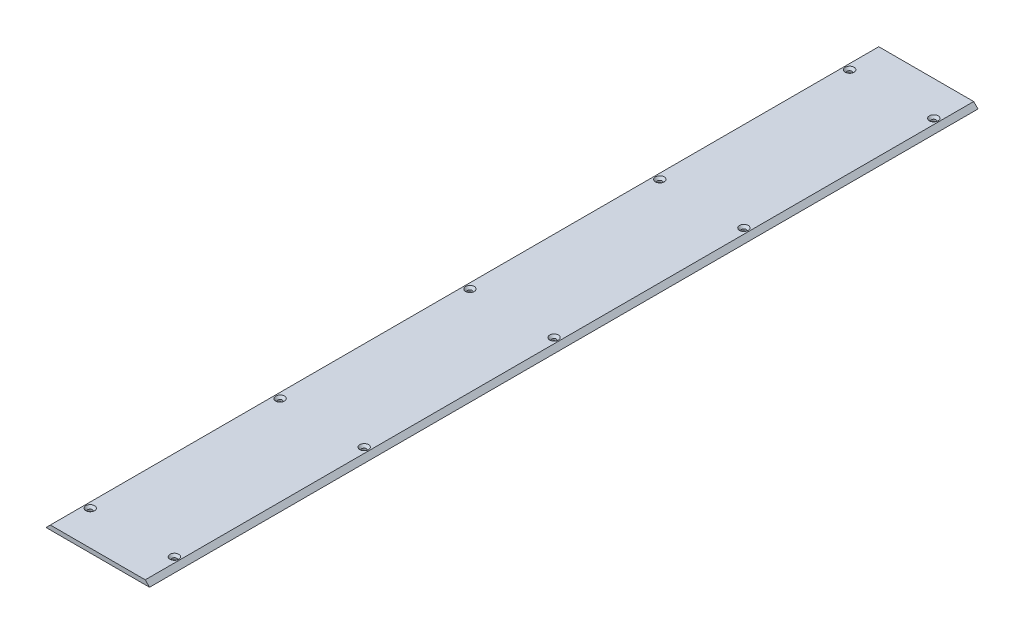
ISO-10303-21;
HEADER;
FILE_DESCRIPTION(('STEP AP214'),'2;1');
FILE_NAME('part.step','',(''),(''),'','','');
FILE_SCHEMA(('AUTOMOTIVE_DESIGN { 1 0 10303 214 1 1 1 1 }'));
ENDSEC;
DATA;
#1=APPLICATION_CONTEXT('core data for automotive mechanical design processes');
#2=APPLICATION_PROTOCOL_DEFINITION('international standard','automotive_design',2000,#1);
#3=PRODUCT_CONTEXT('',#1,'mechanical');
#4=PRODUCT('Part','Part','',(#3));
#5=PRODUCT_RELATED_PRODUCT_CATEGORY('part','',(#4));
#6=PRODUCT_DEFINITION_FORMATION('','',#4);
#7=PRODUCT_DEFINITION_CONTEXT('part definition',#1,'design');
#8=PRODUCT_DEFINITION('design','',#6,#7);
#9=PRODUCT_DEFINITION_SHAPE('','',#8);
#10=(LENGTH_UNIT() NAMED_UNIT(*) SI_UNIT(.MILLI.,.METRE.));
#11=(NAMED_UNIT(*) PLANE_ANGLE_UNIT() SI_UNIT($,.RADIAN.));
#12=(NAMED_UNIT(*) SI_UNIT($,.STERADIAN.) SOLID_ANGLE_UNIT());
#13=UNCERTAINTY_MEASURE_WITH_UNIT(LENGTH_MEASURE(1.E-05),#10,'distance_accuracy_value','');
#14=(GEOMETRIC_REPRESENTATION_CONTEXT(3) GLOBAL_UNCERTAINTY_ASSIGNED_CONTEXT((#13)) GLOBAL_UNIT_ASSIGNED_CONTEXT((#10,
#11,#12)) REPRESENTATION_CONTEXT('',''));
#15=CARTESIAN_POINT('',(0.,0.,0.));
#16=DIRECTION('',(0.,0.,1.));
#17=DIRECTION('',(1.,0.,0.));
#18=AXIS2_PLACEMENT_3D('',#15,#16,#17);
#19=CARTESIAN_POINT('',(0.,6.35,0.));
#20=DIRECTION('',(0.,0.,-1.));
#21=DIRECTION('',(-1.,0.,0.));
#22=AXIS2_PLACEMENT_3D('',#19,#20,#21);
#23=PLANE('',#22);
#24=DIRECTION('',(1.,0.,0.));
#25=VECTOR('',#24,1.);
#26=CARTESIAN_POINT('',(0.,0.,0.));
#27=LINE('',#26,#25);
#28=CARTESIAN_POINT('',(0.,0.,0.));
#29=VERTEX_POINT('',#28);
#30=CARTESIAN_POINT('',(152.4,0.,0.));
#31=VERTEX_POINT('',#30);
#32=EDGE_CURVE('E85',#29,#31,#27,.T.);
#33=ORIENTED_EDGE('',*,*,#32,.T.);
#34=DIRECTION('',(0.707106781186548,-0.707106781186548,0.));
#35=VECTOR('',#34,1.);
#36=CARTESIAN_POINT('',(146.05,6.35,0.));
#37=LINE('',#36,#35);
#38=CARTESIAN_POINT('',(146.05,6.35,0.));
#39=VERTEX_POINT('',#38);
#40=EDGE_CURVE('E11',#31,#39,#37,.F.);
#41=ORIENTED_EDGE('',*,*,#40,.T.);
#42=DIRECTION('',(1.,0.,0.));
#43=VECTOR('',#42,1.);
#44=CARTESIAN_POINT('',(0.,6.35,0.));
#45=LINE('',#44,#43);
#46=CARTESIAN_POINT('',(6.34999999999985,6.35,0.));
#47=VERTEX_POINT('',#46);
#48=EDGE_CURVE('E88',#47,#39,#45,.T.);
#49=ORIENTED_EDGE('',*,*,#48,.F.);
#50=DIRECTION('',(0.707106781186541,0.707106781186554,0.));
#51=VECTOR('',#50,1.);
#52=CARTESIAN_POINT('',(6.34999999999986,6.35,0.));
#53=LINE('',#52,#51);
#54=EDGE_CURVE('E47',#47,#29,#53,.F.);
#55=ORIENTED_EDGE('',*,*,#54,.T.);
#56=EDGE_LOOP('',(#33,#41,#49,#55));
#57=FACE_BOUND('',#56,.T.);
#58=ADVANCED_FACE('F38',(#57),#23,.F.);
#59=CARTESIAN_POINT('',(0.,6.35,-1219.2));
#60=DIRECTION('',(0.,0.,1.));
#61=DIRECTION('',(1.,0.,0.));
#62=AXIS2_PLACEMENT_3D('',#59,#60,#61);
#63=PLANE('',#62);
#64=DIRECTION('',(-1.,0.,0.));
#65=VECTOR('',#64,1.);
#66=CARTESIAN_POINT('',(0.,6.35,-1219.2));
#67=LINE('',#66,#65);
#68=CARTESIAN_POINT('',(146.05,6.35,-1219.2));
#69=VERTEX_POINT('',#68);
#70=CARTESIAN_POINT('',(6.34999999999985,6.35,-1219.2));
#71=VERTEX_POINT('',#70);
#72=EDGE_CURVE('E112',#69,#71,#67,.T.);
#73=ORIENTED_EDGE('',*,*,#72,.F.);
#74=DIRECTION('',(-0.707106781186548,0.707106781186548,0.));
#75=VECTOR('',#74,1.);
#76=CARTESIAN_POINT('',(146.05,6.35,-1219.2));
#77=LINE('',#76,#75);
#78=CARTESIAN_POINT('',(152.4,0.,-1219.2));
#79=VERTEX_POINT('',#78);
#80=EDGE_CURVE('E62',#69,#79,#77,.F.);
#81=ORIENTED_EDGE('',*,*,#80,.T.);
#82=DIRECTION('',(-1.,0.,0.));
#83=VECTOR('',#82,1.);
#84=CARTESIAN_POINT('',(0.,0.,-1219.2));
#85=LINE('',#84,#83);
#86=CARTESIAN_POINT('',(0.,0.,-1219.2));
#87=VERTEX_POINT('',#86);
#88=EDGE_CURVE('E117',#79,#87,#85,.T.);
#89=ORIENTED_EDGE('',*,*,#88,.T.);
#90=DIRECTION('',(-0.707106781186541,-0.707106781186554,0.));
#91=VECTOR('',#90,1.);
#92=CARTESIAN_POINT('',(6.34999999999986,6.35,-1219.2));
#93=LINE('',#92,#91);
#94=EDGE_CURVE('E54',#87,#71,#93,.F.);
#95=ORIENTED_EDGE('',*,*,#94,.T.);
#96=EDGE_LOOP('',(#73,#81,#89,#95));
#97=FACE_BOUND('',#96,.T.);
#98=ADVANCED_FACE('F126',(#97),#63,.F.);
#99=CARTESIAN_POINT('',(0.,6.35,0.));
#100=DIRECTION('',(0.,-1.,0.));
#101=DIRECTION('',(0.,0.,-1.));
#102=AXIS2_PLACEMENT_3D('',#99,#100,#101);
#103=PLANE('',#102);
#104=CARTESIAN_POINT('',(14.2874999999941,6.35,-1168.4));
#105=DIRECTION('',(0.,1.,0.));
#106=DIRECTION('',(0.,0.,1.));
#107=AXIS2_PLACEMENT_3D('',#104,#105,#106);
#108=CIRCLE('',#107,6.4389);
#109=CARTESIAN_POINT('',(14.2874999999941,6.35,-1161.9611));
#110=VERTEX_POINT('',#109);
#111=EDGE_CURVE('E225',#110,#110,#108,.T.);
#112=ORIENTED_EDGE('',*,*,#111,.F.);
#113=EDGE_LOOP('',(#112));
#114=FACE_BOUND('',#113,.T.);
#115=CARTESIAN_POINT('',(138.112499999994,6.35,-1168.4));
#116=DIRECTION('',(0.,1.,0.));
#117=DIRECTION('',(0.,0.,1.));
#118=AXIS2_PLACEMENT_3D('',#115,#116,#117);
#119=CIRCLE('',#118,6.4389);
#120=CARTESIAN_POINT('',(138.112499999994,6.35,-1161.9611));
#121=VERTEX_POINT('',#120);
#122=EDGE_CURVE('E216',#121,#121,#119,.T.);
#123=ORIENTED_EDGE('',*,*,#122,.F.);
#124=EDGE_LOOP('',(#123));
#125=FACE_BOUND('',#124,.T.);
#126=CARTESIAN_POINT('',(138.112499999997,6.35,-889.));
#127=DIRECTION('',(0.,1.,0.));
#128=DIRECTION('',(0.,0.,1.));
#129=AXIS2_PLACEMENT_3D('',#126,#127,#128);
#130=CIRCLE('',#129,6.4389);
#131=CARTESIAN_POINT('',(138.112499999997,6.35,-882.5611));
#132=VERTEX_POINT('',#131);
#133=EDGE_CURVE('E207',#132,#132,#130,.T.);
#134=ORIENTED_EDGE('',*,*,#133,.F.);
#135=EDGE_LOOP('',(#134));
#136=FACE_BOUND('',#135,.T.);
#137=CARTESIAN_POINT('',(138.1125,6.35,-609.6));
#138=DIRECTION('',(0.,1.,0.));
#139=DIRECTION('',(0.,0.,1.));
#140=AXIS2_PLACEMENT_3D('',#137,#138,#139);
#141=CIRCLE('',#140,6.4389);
#142=CARTESIAN_POINT('',(138.1125,6.35,-603.1611));
#143=VERTEX_POINT('',#142);
#144=EDGE_CURVE('E198',#143,#143,#141,.T.);
#145=ORIENTED_EDGE('',*,*,#144,.F.);
#146=EDGE_LOOP('',(#145));
#147=FACE_BOUND('',#146,.T.);
#148=CARTESIAN_POINT('',(138.112500000003,6.35,-330.2));
#149=DIRECTION('',(0.,1.,0.));
#150=DIRECTION('',(0.,0.,1.));
#151=AXIS2_PLACEMENT_3D('',#148,#149,#150);
#152=CIRCLE('',#151,6.4389);
#153=CARTESIAN_POINT('',(138.112500000003,6.35,-323.7611));
#154=VERTEX_POINT('',#153);
#155=EDGE_CURVE('E188',#154,#154,#152,.T.);
#156=ORIENTED_EDGE('',*,*,#155,.F.);
#157=EDGE_LOOP('',(#156));
#158=FACE_BOUND('',#157,.T.);
#159=CARTESIAN_POINT('',(138.112500000006,6.35,-50.8000000000002));
#160=DIRECTION('',(0.,1.,0.));
#161=DIRECTION('',(0.,0.,1.));
#162=AXIS2_PLACEMENT_3D('',#159,#160,#161);
#163=CIRCLE('',#162,6.4389);
#164=CARTESIAN_POINT('',(138.112500000006,6.35,-44.3611000000002));
#165=VERTEX_POINT('',#164);
#166=EDGE_CURVE('E176',#165,#165,#163,.T.);
#167=ORIENTED_EDGE('',*,*,#166,.F.);
#168=EDGE_LOOP('',(#167));
#169=FACE_BOUND('',#168,.T.);
#170=CARTESIAN_POINT('',(14.2874999999971,6.35,-889.));
#171=DIRECTION('',(0.,1.,0.));
#172=DIRECTION('',(0.,0.,1.));
#173=AXIS2_PLACEMENT_3D('',#170,#171,#172);
#174=CIRCLE('',#173,6.4389);
#175=CARTESIAN_POINT('',(14.2874999999971,6.35,-882.5611));
#176=VERTEX_POINT('',#175);
#177=EDGE_CURVE('E166',#176,#176,#174,.T.);
#178=ORIENTED_EDGE('',*,*,#177,.F.);
#179=EDGE_LOOP('',(#178));
#180=FACE_BOUND('',#179,.T.);
#181=CARTESIAN_POINT('',(14.2875,6.35,-609.6));
#182=DIRECTION('',(0.,1.,0.));
#183=DIRECTION('',(0.,0.,1.));
#184=AXIS2_PLACEMENT_3D('',#181,#182,#183);
#185=CIRCLE('',#184,6.4389);
#186=CARTESIAN_POINT('',(14.2875,6.35,-603.1611));
#187=VERTEX_POINT('',#186);
#188=EDGE_CURVE('E157',#187,#187,#185,.T.);
#189=ORIENTED_EDGE('',*,*,#188,.F.);
#190=EDGE_LOOP('',(#189));
#191=FACE_BOUND('',#190,.T.);
#192=CARTESIAN_POINT('',(14.2875000000029,6.35,-330.2));
#193=DIRECTION('',(0.,1.,0.));
#194=DIRECTION('',(0.,0.,1.));
#195=AXIS2_PLACEMENT_3D('',#192,#193,#194);
#196=CIRCLE('',#195,6.4389);
#197=CARTESIAN_POINT('',(14.2875000000029,6.35,-323.7611));
#198=VERTEX_POINT('',#197);
#199=EDGE_CURVE('E147',#198,#198,#196,.T.);
#200=ORIENTED_EDGE('',*,*,#199,.F.);
#201=EDGE_LOOP('',(#200));
#202=FACE_BOUND('',#201,.T.);
#203=CARTESIAN_POINT('',(14.2875000000059,6.35,-50.8000000000002));
#204=DIRECTION('',(0.,1.,0.));
#205=DIRECTION('',(0.,0.,1.));
#206=AXIS2_PLACEMENT_3D('',#203,#204,#205);
#207=CIRCLE('',#206,6.4389);
#208=CARTESIAN_POINT('',(14.2875000000059,6.35,-44.3611000000002));
#209=VERTEX_POINT('',#208);
#210=EDGE_CURVE('E135',#209,#209,#207,.T.);
#211=ORIENTED_EDGE('',*,*,#210,.F.);
#212=EDGE_LOOP('',(#211));
#213=FACE_BOUND('',#212,.T.);
#214=ORIENTED_EDGE('',*,*,#48,.T.);
#215=DIRECTION('',(0.,0.,-1.));
#216=VECTOR('',#215,1.);
#217=CARTESIAN_POINT('',(146.05,6.35,0.));
#218=LINE('',#217,#216);
#219=EDGE_CURVE('E122',#39,#69,#218,.T.);
#220=ORIENTED_EDGE('',*,*,#219,.T.);
#221=ORIENTED_EDGE('',*,*,#72,.T.);
#222=DIRECTION('',(0.,0.,1.));
#223=VECTOR('',#222,1.);
#224=CARTESIAN_POINT('',(6.34999999999986,6.35,0.));
#225=LINE('',#224,#223);
#226=EDGE_CURVE('E119',#71,#47,#225,.T.);
#227=ORIENTED_EDGE('',*,*,#226,.T.);
#228=EDGE_LOOP('',(#214,#220,#221,#227));
#229=FACE_BOUND('',#228,.T.);
#230=ADVANCED_FACE('F129',(#114,#125,#136,#147,#158,#169,#180,#191,#202,#213,#229),#103,.F.);
#231=CARTESIAN_POINT('',(0.,0.,0.));
#232=DIRECTION('',(0.,-1.,0.));
#233=DIRECTION('',(0.,0.,-1.));
#234=AXIS2_PLACEMENT_3D('',#231,#232,#233);
#235=PLANE('',#234);
#236=CARTESIAN_POINT('',(14.2874999999941,0.,-1168.4));
#237=DIRECTION('',(0.,1.,0.));
#238=DIRECTION('',(0.,0.,1.));
#239=AXIS2_PLACEMENT_3D('',#236,#237,#238);
#240=CIRCLE('',#239,3.37819999999999);
#241=CARTESIAN_POINT('',(14.2874999999941,0.,-1165.0218));
#242=VERTEX_POINT('',#241);
#243=EDGE_CURVE('E219',#242,#242,#240,.T.);
#244=ORIENTED_EDGE('',*,*,#243,.T.);
#245=EDGE_LOOP('',(#244));
#246=FACE_BOUND('',#245,.T.);
#247=CARTESIAN_POINT('',(138.112499999994,0.,-1168.4));
#248=DIRECTION('',(0.,1.,0.));
#249=DIRECTION('',(0.,0.,1.));
#250=AXIS2_PLACEMENT_3D('',#247,#248,#249);
#251=CIRCLE('',#250,3.3782);
#252=CARTESIAN_POINT('',(138.112499999994,0.,-1165.0218));
#253=VERTEX_POINT('',#252);
#254=EDGE_CURVE('E210',#253,#253,#251,.T.);
#255=ORIENTED_EDGE('',*,*,#254,.T.);
#256=EDGE_LOOP('',(#255));
#257=FACE_BOUND('',#256,.T.);
#258=CARTESIAN_POINT('',(138.112499999997,0.,-889.));
#259=DIRECTION('',(0.,1.,0.));
#260=DIRECTION('',(0.,0.,1.));
#261=AXIS2_PLACEMENT_3D('',#258,#259,#260);
#262=CIRCLE('',#261,3.3782);
#263=CARTESIAN_POINT('',(138.112499999997,0.,-885.6218));
#264=VERTEX_POINT('',#263);
#265=EDGE_CURVE('E201',#264,#264,#262,.T.);
#266=ORIENTED_EDGE('',*,*,#265,.T.);
#267=EDGE_LOOP('',(#266));
#268=FACE_BOUND('',#267,.T.);
#269=CARTESIAN_POINT('',(138.1125,0.,-609.6));
#270=DIRECTION('',(0.,1.,0.));
#271=DIRECTION('',(0.,0.,1.));
#272=AXIS2_PLACEMENT_3D('',#269,#270,#271);
#273=CIRCLE('',#272,3.3782);
#274=CARTESIAN_POINT('',(138.1125,0.,-606.2218));
#275=VERTEX_POINT('',#274);
#276=EDGE_CURVE('E192',#275,#275,#273,.T.);
#277=ORIENTED_EDGE('',*,*,#276,.T.);
#278=EDGE_LOOP('',(#277));
#279=FACE_BOUND('',#278,.T.);
#280=CARTESIAN_POINT('',(138.112500000003,0.,-330.2));
#281=DIRECTION('',(0.,1.,0.));
#282=DIRECTION('',(0.,0.,1.));
#283=AXIS2_PLACEMENT_3D('',#280,#281,#282);
#284=CIRCLE('',#283,3.3782);
#285=CARTESIAN_POINT('',(138.112500000003,0.,-326.8218));
#286=VERTEX_POINT('',#285);
#287=EDGE_CURVE('E180',#286,#286,#284,.T.);
#288=ORIENTED_EDGE('',*,*,#287,.T.);
#289=EDGE_LOOP('',(#288));
#290=FACE_BOUND('',#289,.T.);
#291=CARTESIAN_POINT('',(138.112500000006,0.,-50.8000000000002));
#292=DIRECTION('',(0.,1.,0.));
#293=DIRECTION('',(0.,0.,1.));
#294=AXIS2_PLACEMENT_3D('',#291,#292,#293);
#295=CIRCLE('',#294,3.3782);
#296=CARTESIAN_POINT('',(138.112500000006,0.,-47.4218000000002));
#297=VERTEX_POINT('',#296);
#298=EDGE_CURVE('E169',#297,#297,#295,.T.);
#299=ORIENTED_EDGE('',*,*,#298,.T.);
#300=EDGE_LOOP('',(#299));
#301=FACE_BOUND('',#300,.T.);
#302=CARTESIAN_POINT('',(14.2874999999971,0.,-889.));
#303=DIRECTION('',(0.,1.,0.));
#304=DIRECTION('',(0.,0.,1.));
#305=AXIS2_PLACEMENT_3D('',#302,#303,#304);
#306=CIRCLE('',#305,3.37819999999999);
#307=CARTESIAN_POINT('',(14.2874999999971,0.,-885.6218));
#308=VERTEX_POINT('',#307);
#309=EDGE_CURVE('E160',#308,#308,#306,.T.);
#310=ORIENTED_EDGE('',*,*,#309,.T.);
#311=EDGE_LOOP('',(#310));
#312=FACE_BOUND('',#311,.T.);
#313=CARTESIAN_POINT('',(14.2875,0.,-609.6));
#314=DIRECTION('',(0.,1.,0.));
#315=DIRECTION('',(0.,0.,1.));
#316=AXIS2_PLACEMENT_3D('',#313,#314,#315);
#317=CIRCLE('',#316,3.37819999999999);
#318=CARTESIAN_POINT('',(14.2875,0.,-606.2218));
#319=VERTEX_POINT('',#318);
#320=EDGE_CURVE('E151',#319,#319,#317,.T.);
#321=ORIENTED_EDGE('',*,*,#320,.T.);
#322=EDGE_LOOP('',(#321));
#323=FACE_BOUND('',#322,.T.);
#324=CARTESIAN_POINT('',(14.2875000000029,0.,-330.2));
#325=DIRECTION('',(0.,1.,0.));
#326=DIRECTION('',(0.,0.,1.));
#327=AXIS2_PLACEMENT_3D('',#324,#325,#326);
#328=CIRCLE('',#327,3.37819999999999);
#329=CARTESIAN_POINT('',(14.2875000000029,0.,-326.8218));
#330=VERTEX_POINT('',#329);
#331=EDGE_CURVE('E139',#330,#330,#328,.T.);
#332=ORIENTED_EDGE('',*,*,#331,.T.);
#333=EDGE_LOOP('',(#332));
#334=FACE_BOUND('',#333,.T.);
#335=CARTESIAN_POINT('',(14.2875000000059,0.,-50.8000000000002));
#336=DIRECTION('',(0.,1.,0.));
#337=DIRECTION('',(0.,0.,1.));
#338=AXIS2_PLACEMENT_3D('',#335,#336,#337);
#339=CIRCLE('',#338,3.37819999999999);
#340=CARTESIAN_POINT('',(14.2875000000059,0.,-47.4218000000002));
#341=VERTEX_POINT('',#340);
#342=EDGE_CURVE('E104',#341,#341,#339,.T.);
#343=ORIENTED_EDGE('',*,*,#342,.T.);
#344=EDGE_LOOP('',(#343));
#345=FACE_BOUND('',#344,.T.);
#346=DIRECTION('',(0.,0.,1.));
#347=VECTOR('',#346,1.);
#348=CARTESIAN_POINT('',(0.,0.,0.));
#349=LINE('',#348,#347);
#350=EDGE_CURVE('E98',#87,#29,#349,.T.);
#351=ORIENTED_EDGE('',*,*,#350,.F.);
#352=ORIENTED_EDGE('',*,*,#88,.F.);
#353=DIRECTION('',(0.,0.,-1.));
#354=VECTOR('',#353,1.);
#355=CARTESIAN_POINT('',(152.4,0.,0.));
#356=LINE('',#355,#354);
#357=EDGE_CURVE('E99',#31,#79,#356,.T.);
#358=ORIENTED_EDGE('',*,*,#357,.F.);
#359=ORIENTED_EDGE('',*,*,#32,.F.);
#360=EDGE_LOOP('',(#351,#352,#358,#359));
#361=FACE_BOUND('',#360,.T.);
#362=ADVANCED_FACE('F96',(#246,#257,#268,#279,#290,#301,#312,#323,#334,#345,#361),#235,.T.);
#363=CARTESIAN_POINT('',(14.2875000000059,6.35,-50.8000000000002));
#364=DIRECTION('',(0.,1.,0.));
#365=DIRECTION('',(0.,0.,1.));
#366=AXIS2_PLACEMENT_3D('',#363,#364,#365);
#367=CYLINDRICAL_SURFACE('',#366,3.37819999999999);
#368=ORIENTED_EDGE('',*,*,#342,.F.);
#369=EDGE_LOOP('',(#368));
#370=FACE_BOUND('',#369,.T.);
#371=CARTESIAN_POINT('',(14.2875000000059,2.82906741601866,-50.8000000000002));
#372=DIRECTION('',(0.,1.,0.));
#373=DIRECTION('',(0.,0.,1.));
#374=AXIS2_PLACEMENT_3D('',#371,#372,#373);
#375=CIRCLE('',#374,3.3782);
#376=CARTESIAN_POINT('',(14.2875000000059,2.82906741601866,-47.4218000000002));
#377=VERTEX_POINT('',#376);
#378=EDGE_CURVE('E109',#377,#377,#375,.T.);
#379=ORIENTED_EDGE('',*,*,#378,.T.);
#380=EDGE_LOOP('',(#379));
#381=FACE_BOUND('',#380,.T.);
#382=ADVANCED_FACE('F255',(#370,#381),#367,.F.);
#383=CARTESIAN_POINT('',(14.2875000000059,6.35,-50.8000000000002));
#384=DIRECTION('',(0.,1.,0.));
#385=DIRECTION('',(0.,0.,1.));
#386=AXIS2_PLACEMENT_3D('',#383,#384,#385);
#387=CONICAL_SURFACE('',#386,6.4389,0.715584993317675);
#388=ORIENTED_EDGE('',*,*,#378,.F.);
#389=EDGE_LOOP('',(#388));
#390=FACE_BOUND('',#389,.T.);
#391=ORIENTED_EDGE('',*,*,#210,.T.);
#392=EDGE_LOOP('',(#391));
#393=FACE_BOUND('',#392,.T.);
#394=ADVANCED_FACE('F252',(#390,#393),#387,.F.);
#395=CARTESIAN_POINT('',(14.2875000000029,6.35,-330.2));
#396=DIRECTION('',(0.,1.,0.));
#397=DIRECTION('',(0.,0.,1.));
#398=AXIS2_PLACEMENT_3D('',#395,#396,#397);
#399=CYLINDRICAL_SURFACE('',#398,3.37819999999999);
#400=ORIENTED_EDGE('',*,*,#331,.F.);
#401=EDGE_LOOP('',(#400));
#402=FACE_BOUND('',#401,.T.);
#403=CARTESIAN_POINT('',(14.2875000000029,2.82906741601866,-330.2));
#404=DIRECTION('',(0.,1.,0.));
#405=DIRECTION('',(0.,0.,1.));
#406=AXIS2_PLACEMENT_3D('',#403,#404,#405);
#407=CIRCLE('',#406,3.3782);
#408=CARTESIAN_POINT('',(14.2875000000029,2.82906741601866,-326.8218));
#409=VERTEX_POINT('',#408);
#410=EDGE_CURVE('E143',#409,#409,#407,.T.);
#411=ORIENTED_EDGE('',*,*,#410,.T.);
#412=EDGE_LOOP('',(#411));
#413=FACE_BOUND('',#412,.T.);
#414=ADVANCED_FACE('F254',(#402,#413),#399,.F.);
#415=CARTESIAN_POINT('',(14.2875000000029,6.35,-330.2));
#416=DIRECTION('',(0.,1.,0.));
#417=DIRECTION('',(0.,0.,1.));
#418=AXIS2_PLACEMENT_3D('',#415,#416,#417);
#419=CONICAL_SURFACE('',#418,6.4389,0.715584993317675);
#420=ORIENTED_EDGE('',*,*,#410,.F.);
#421=EDGE_LOOP('',(#420));
#422=FACE_BOUND('',#421,.T.);
#423=ORIENTED_EDGE('',*,*,#199,.T.);
#424=EDGE_LOOP('',(#423));
#425=FACE_BOUND('',#424,.T.);
#426=ADVANCED_FACE('F262',(#422,#425),#419,.F.);
#427=CARTESIAN_POINT('',(14.2875,6.35,-609.6));
#428=DIRECTION('',(0.,1.,0.));
#429=DIRECTION('',(0.,0.,1.));
#430=AXIS2_PLACEMENT_3D('',#427,#428,#429);
#431=CYLINDRICAL_SURFACE('',#430,3.37819999999999);
#432=ORIENTED_EDGE('',*,*,#320,.F.);
#433=EDGE_LOOP('',(#432));
#434=FACE_BOUND('',#433,.T.);
#435=CARTESIAN_POINT('',(14.2875,2.82906741601866,-609.6));
#436=DIRECTION('',(0.,1.,0.));
#437=DIRECTION('',(0.,0.,1.));
#438=AXIS2_PLACEMENT_3D('',#435,#436,#437);
#439=CIRCLE('',#438,3.3782);
#440=CARTESIAN_POINT('',(14.2875,2.82906741601866,-606.2218));
#441=VERTEX_POINT('',#440);
#442=EDGE_CURVE('E154',#441,#441,#439,.T.);
#443=ORIENTED_EDGE('',*,*,#442,.T.);
#444=EDGE_LOOP('',(#443));
#445=FACE_BOUND('',#444,.T.);
#446=ADVANCED_FACE('F341',(#434,#445),#431,.F.);
#447=CARTESIAN_POINT('',(14.2875,6.35,-609.6));
#448=DIRECTION('',(0.,1.,0.));
#449=DIRECTION('',(0.,0.,1.));
#450=AXIS2_PLACEMENT_3D('',#447,#448,#449);
#451=CONICAL_SURFACE('',#450,6.4389,0.715584993317675);
#452=ORIENTED_EDGE('',*,*,#442,.F.);
#453=EDGE_LOOP('',(#452));
#454=FACE_BOUND('',#453,.T.);
#455=ORIENTED_EDGE('',*,*,#188,.T.);
#456=EDGE_LOOP('',(#455));
#457=FACE_BOUND('',#456,.T.);
#458=ADVANCED_FACE('F337',(#454,#457),#451,.F.);
#459=CARTESIAN_POINT('',(14.2874999999971,6.35,-889.));
#460=DIRECTION('',(0.,1.,0.));
#461=DIRECTION('',(0.,0.,1.));
#462=AXIS2_PLACEMENT_3D('',#459,#460,#461);
#463=CYLINDRICAL_SURFACE('',#462,3.37819999999999);
#464=ORIENTED_EDGE('',*,*,#309,.F.);
#465=EDGE_LOOP('',(#464));
#466=FACE_BOUND('',#465,.T.);
#467=CARTESIAN_POINT('',(14.2874999999971,2.82906741601866,-889.));
#468=DIRECTION('',(0.,1.,0.));
#469=DIRECTION('',(0.,0.,1.));
#470=AXIS2_PLACEMENT_3D('',#467,#468,#469);
#471=CIRCLE('',#470,3.3782);
#472=CARTESIAN_POINT('',(14.2874999999971,2.82906741601866,-885.6218));
#473=VERTEX_POINT('',#472);
#474=EDGE_CURVE('E163',#473,#473,#471,.T.);
#475=ORIENTED_EDGE('',*,*,#474,.T.);
#476=EDGE_LOOP('',(#475));
#477=FACE_BOUND('',#476,.T.);
#478=ADVANCED_FACE('F333',(#466,#477),#463,.F.);
#479=CARTESIAN_POINT('',(14.2874999999971,6.35,-889.));
#480=DIRECTION('',(0.,1.,0.));
#481=DIRECTION('',(0.,0.,1.));
#482=AXIS2_PLACEMENT_3D('',#479,#480,#481);
#483=CONICAL_SURFACE('',#482,6.4389,0.715584993317675);
#484=ORIENTED_EDGE('',*,*,#474,.F.);
#485=EDGE_LOOP('',(#484));
#486=FACE_BOUND('',#485,.T.);
#487=ORIENTED_EDGE('',*,*,#177,.T.);
#488=EDGE_LOOP('',(#487));
#489=FACE_BOUND('',#488,.T.);
#490=ADVANCED_FACE('F329',(#486,#489),#483,.F.);
#491=CARTESIAN_POINT('',(138.112500000006,6.35,-50.8000000000002));
#492=DIRECTION('',(0.,1.,0.));
#493=DIRECTION('',(0.,0.,1.));
#494=AXIS2_PLACEMENT_3D('',#491,#492,#493);
#495=CYLINDRICAL_SURFACE('',#494,3.3782);
#496=ORIENTED_EDGE('',*,*,#298,.F.);
#497=EDGE_LOOP('',(#496));
#498=FACE_BOUND('',#497,.T.);
#499=CARTESIAN_POINT('',(138.112500000006,2.82906741601866,-50.8000000000002));
#500=DIRECTION('',(0.,1.,0.));
#501=DIRECTION('',(0.,0.,1.));
#502=AXIS2_PLACEMENT_3D('',#499,#500,#501);
#503=CIRCLE('',#502,3.3782);
#504=CARTESIAN_POINT('',(138.112500000006,2.82906741601866,-47.4218000000002));
#505=VERTEX_POINT('',#504);
#506=EDGE_CURVE('E172',#505,#505,#503,.T.);
#507=ORIENTED_EDGE('',*,*,#506,.T.);
#508=EDGE_LOOP('',(#507));
#509=FACE_BOUND('',#508,.T.);
#510=ADVANCED_FACE('F325',(#498,#509),#495,.F.);
#511=CARTESIAN_POINT('',(138.112500000006,6.35,-50.8000000000002));
#512=DIRECTION('',(0.,1.,0.));
#513=DIRECTION('',(0.,0.,1.));
#514=AXIS2_PLACEMENT_3D('',#511,#512,#513);
#515=CONICAL_SURFACE('',#514,6.4389,0.715584993317675);
#516=ORIENTED_EDGE('',*,*,#506,.F.);
#517=EDGE_LOOP('',(#516));
#518=FACE_BOUND('',#517,.T.);
#519=ORIENTED_EDGE('',*,*,#166,.T.);
#520=EDGE_LOOP('',(#519));
#521=FACE_BOUND('',#520,.T.);
#522=ADVANCED_FACE('F321',(#518,#521),#515,.F.);
#523=CARTESIAN_POINT('',(138.112500000003,6.35,-330.2));
#524=DIRECTION('',(0.,1.,0.));
#525=DIRECTION('',(0.,0.,1.));
#526=AXIS2_PLACEMENT_3D('',#523,#524,#525);
#527=CYLINDRICAL_SURFACE('',#526,3.3782);
#528=ORIENTED_EDGE('',*,*,#287,.F.);
#529=EDGE_LOOP('',(#528));
#530=FACE_BOUND('',#529,.T.);
#531=CARTESIAN_POINT('',(138.112500000003,2.82906741601866,-330.2));
#532=DIRECTION('',(0.,1.,0.));
#533=DIRECTION('',(0.,0.,1.));
#534=AXIS2_PLACEMENT_3D('',#531,#532,#533);
#535=CIRCLE('',#534,3.3782);
#536=CARTESIAN_POINT('',(138.112500000003,2.82906741601866,-326.8218));
#537=VERTEX_POINT('',#536);
#538=EDGE_CURVE('E184',#537,#537,#535,.T.);
#539=ORIENTED_EDGE('',*,*,#538,.T.);
#540=EDGE_LOOP('',(#539));
#541=FACE_BOUND('',#540,.T.);
#542=ADVANCED_FACE('F317',(#530,#541),#527,.F.);
#543=CARTESIAN_POINT('',(138.112500000003,6.35,-330.2));
#544=DIRECTION('',(0.,1.,0.));
#545=DIRECTION('',(0.,0.,1.));
#546=AXIS2_PLACEMENT_3D('',#543,#544,#545);
#547=CONICAL_SURFACE('',#546,6.4389,0.715584993317675);
#548=ORIENTED_EDGE('',*,*,#538,.F.);
#549=EDGE_LOOP('',(#548));
#550=FACE_BOUND('',#549,.T.);
#551=ORIENTED_EDGE('',*,*,#155,.T.);
#552=EDGE_LOOP('',(#551));
#553=FACE_BOUND('',#552,.T.);
#554=ADVANCED_FACE('F313',(#550,#553),#547,.F.);
#555=CARTESIAN_POINT('',(138.1125,6.35,-609.6));
#556=DIRECTION('',(0.,1.,0.));
#557=DIRECTION('',(0.,0.,1.));
#558=AXIS2_PLACEMENT_3D('',#555,#556,#557);
#559=CYLINDRICAL_SURFACE('',#558,3.3782);
#560=ORIENTED_EDGE('',*,*,#276,.F.);
#561=EDGE_LOOP('',(#560));
#562=FACE_BOUND('',#561,.T.);
#563=CARTESIAN_POINT('',(138.1125,2.82906741601866,-609.6));
#564=DIRECTION('',(0.,1.,0.));
#565=DIRECTION('',(0.,0.,1.));
#566=AXIS2_PLACEMENT_3D('',#563,#564,#565);
#567=CIRCLE('',#566,3.3782);
#568=CARTESIAN_POINT('',(138.1125,2.82906741601866,-606.2218));
#569=VERTEX_POINT('',#568);
#570=EDGE_CURVE('E195',#569,#569,#567,.T.);
#571=ORIENTED_EDGE('',*,*,#570,.T.);
#572=EDGE_LOOP('',(#571));
#573=FACE_BOUND('',#572,.T.);
#574=ADVANCED_FACE('F309',(#562,#573),#559,.F.);
#575=CARTESIAN_POINT('',(138.1125,6.35,-609.6));
#576=DIRECTION('',(0.,1.,0.));
#577=DIRECTION('',(0.,0.,1.));
#578=AXIS2_PLACEMENT_3D('',#575,#576,#577);
#579=CONICAL_SURFACE('',#578,6.4389,0.715584993317675);
#580=ORIENTED_EDGE('',*,*,#570,.F.);
#581=EDGE_LOOP('',(#580));
#582=FACE_BOUND('',#581,.T.);
#583=ORIENTED_EDGE('',*,*,#144,.T.);
#584=EDGE_LOOP('',(#583));
#585=FACE_BOUND('',#584,.T.);
#586=ADVANCED_FACE('F305',(#582,#585),#579,.F.);
#587=CARTESIAN_POINT('',(138.112499999997,6.35,-889.));
#588=DIRECTION('',(0.,1.,0.));
#589=DIRECTION('',(0.,0.,1.));
#590=AXIS2_PLACEMENT_3D('',#587,#588,#589);
#591=CYLINDRICAL_SURFACE('',#590,3.3782);
#592=ORIENTED_EDGE('',*,*,#265,.F.);
#593=EDGE_LOOP('',(#592));
#594=FACE_BOUND('',#593,.T.);
#595=CARTESIAN_POINT('',(138.112499999997,2.82906741601866,-889.));
#596=DIRECTION('',(0.,1.,0.));
#597=DIRECTION('',(0.,0.,1.));
#598=AXIS2_PLACEMENT_3D('',#595,#596,#597);
#599=CIRCLE('',#598,3.3782);
#600=CARTESIAN_POINT('',(138.112499999997,2.82906741601866,-885.6218));
#601=VERTEX_POINT('',#600);
#602=EDGE_CURVE('E204',#601,#601,#599,.T.);
#603=ORIENTED_EDGE('',*,*,#602,.T.);
#604=EDGE_LOOP('',(#603));
#605=FACE_BOUND('',#604,.T.);
#606=ADVANCED_FACE('F301',(#594,#605),#591,.F.);
#607=CARTESIAN_POINT('',(138.112499999997,6.35,-889.));
#608=DIRECTION('',(0.,1.,0.));
#609=DIRECTION('',(0.,0.,1.));
#610=AXIS2_PLACEMENT_3D('',#607,#608,#609);
#611=CONICAL_SURFACE('',#610,6.4389,0.715584993317675);
#612=ORIENTED_EDGE('',*,*,#602,.F.);
#613=EDGE_LOOP('',(#612));
#614=FACE_BOUND('',#613,.T.);
#615=ORIENTED_EDGE('',*,*,#133,.T.);
#616=EDGE_LOOP('',(#615));
#617=FACE_BOUND('',#616,.T.);
#618=ADVANCED_FACE('F297',(#614,#617),#611,.F.);
#619=CARTESIAN_POINT('',(138.112499999994,6.35,-1168.4));
#620=DIRECTION('',(0.,1.,0.));
#621=DIRECTION('',(0.,0.,1.));
#622=AXIS2_PLACEMENT_3D('',#619,#620,#621);
#623=CYLINDRICAL_SURFACE('',#622,3.3782);
#624=ORIENTED_EDGE('',*,*,#254,.F.);
#625=EDGE_LOOP('',(#624));
#626=FACE_BOUND('',#625,.T.);
#627=CARTESIAN_POINT('',(138.112499999994,2.82906741601866,-1168.4));
#628=DIRECTION('',(0.,1.,0.));
#629=DIRECTION('',(0.,0.,1.));
#630=AXIS2_PLACEMENT_3D('',#627,#628,#629);
#631=CIRCLE('',#630,3.3782);
#632=CARTESIAN_POINT('',(138.112499999994,2.82906741601866,-1165.0218));
#633=VERTEX_POINT('',#632);
#634=EDGE_CURVE('E213',#633,#633,#631,.T.);
#635=ORIENTED_EDGE('',*,*,#634,.T.);
#636=EDGE_LOOP('',(#635));
#637=FACE_BOUND('',#636,.T.);
#638=ADVANCED_FACE('F293',(#626,#637),#623,.F.);
#639=CARTESIAN_POINT('',(138.112499999994,6.35,-1168.4));
#640=DIRECTION('',(0.,1.,0.));
#641=DIRECTION('',(0.,0.,1.));
#642=AXIS2_PLACEMENT_3D('',#639,#640,#641);
#643=CONICAL_SURFACE('',#642,6.4389,0.715584993317675);
#644=ORIENTED_EDGE('',*,*,#634,.F.);
#645=EDGE_LOOP('',(#644));
#646=FACE_BOUND('',#645,.T.);
#647=ORIENTED_EDGE('',*,*,#122,.T.);
#648=EDGE_LOOP('',(#647));
#649=FACE_BOUND('',#648,.T.);
#650=ADVANCED_FACE('F286',(#646,#649),#643,.F.);
#651=CARTESIAN_POINT('',(14.2874999999941,6.35,-1168.4));
#652=DIRECTION('',(0.,1.,0.));
#653=DIRECTION('',(0.,0.,1.));
#654=AXIS2_PLACEMENT_3D('',#651,#652,#653);
#655=CYLINDRICAL_SURFACE('',#654,3.37819999999999);
#656=ORIENTED_EDGE('',*,*,#243,.F.);
#657=EDGE_LOOP('',(#656));
#658=FACE_BOUND('',#657,.T.);
#659=CARTESIAN_POINT('',(14.2874999999941,2.82906741601866,-1168.4));
#660=DIRECTION('',(0.,1.,0.));
#661=DIRECTION('',(0.,0.,1.));
#662=AXIS2_PLACEMENT_3D('',#659,#660,#661);
#663=CIRCLE('',#662,3.3782);
#664=CARTESIAN_POINT('',(14.2874999999941,2.82906741601866,-1165.0218));
#665=VERTEX_POINT('',#664);
#666=EDGE_CURVE('E222',#665,#665,#663,.T.);
#667=ORIENTED_EDGE('',*,*,#666,.T.);
#668=EDGE_LOOP('',(#667));
#669=FACE_BOUND('',#668,.T.);
#670=ADVANCED_FACE('F280',(#658,#669),#655,.F.);
#671=CARTESIAN_POINT('',(14.2874999999941,6.35,-1168.4));
#672=DIRECTION('',(0.,1.,0.));
#673=DIRECTION('',(0.,0.,1.));
#674=AXIS2_PLACEMENT_3D('',#671,#672,#673);
#675=CONICAL_SURFACE('',#674,6.4389,0.715584993317675);
#676=ORIENTED_EDGE('',*,*,#666,.F.);
#677=EDGE_LOOP('',(#676));
#678=FACE_BOUND('',#677,.T.);
#679=ORIENTED_EDGE('',*,*,#111,.T.);
#680=EDGE_LOOP('',(#679));
#681=FACE_BOUND('',#680,.T.);
#682=ADVANCED_FACE('F229',(#678,#681),#675,.F.);
#683=CARTESIAN_POINT('',(146.05,6.35,0.));
#684=DIRECTION('',(-0.707106781186548,-0.707106781186548,0.));
#685=DIRECTION('',(0.,0.,-1.));
#686=AXIS2_PLACEMENT_3D('',#683,#684,#685);
#687=PLANE('',#686);
#688=ORIENTED_EDGE('',*,*,#40,.F.);
#689=ORIENTED_EDGE('',*,*,#357,.T.);
#690=ORIENTED_EDGE('',*,*,#80,.F.);
#691=ORIENTED_EDGE('',*,*,#219,.F.);
#692=EDGE_LOOP('',(#688,#689,#690,#691));
#693=FACE_BOUND('',#692,.T.);
#694=ADVANCED_FACE('F127',(#693),#687,.F.);
#695=CARTESIAN_POINT('',(6.34999999999986,6.35,0.));
#696=DIRECTION('',(0.707106781186554,-0.707106781186541,0.));
#697=DIRECTION('',(0.,0.,1.));
#698=AXIS2_PLACEMENT_3D('',#695,#696,#697);
#699=PLANE('',#698);
#700=ORIENTED_EDGE('',*,*,#94,.F.);
#701=ORIENTED_EDGE('',*,*,#350,.T.);
#702=ORIENTED_EDGE('',*,*,#54,.F.);
#703=ORIENTED_EDGE('',*,*,#226,.F.);
#704=EDGE_LOOP('',(#700,#701,#702,#703));
#705=FACE_BOUND('',#704,.T.);
#706=ADVANCED_FACE('F40',(#705),#699,.F.);
#707=CLOSED_SHELL('',(#58,#98,#230,#362,#382,#394,#414,#426,#446,#458,#478,#490,#510,#522,#542,
#554,#574,#586,#606,#618,#638,#650,#670,#682,#694,#706));
#708=MANIFOLD_SOLID_BREP('B2',#707);
#709=ADVANCED_BREP_SHAPE_REPRESENTATION('',(#18,#708),#14);
#710=SHAPE_DEFINITION_REPRESENTATION(#9,#709);
ENDSEC;
END-ISO-10303-21;
